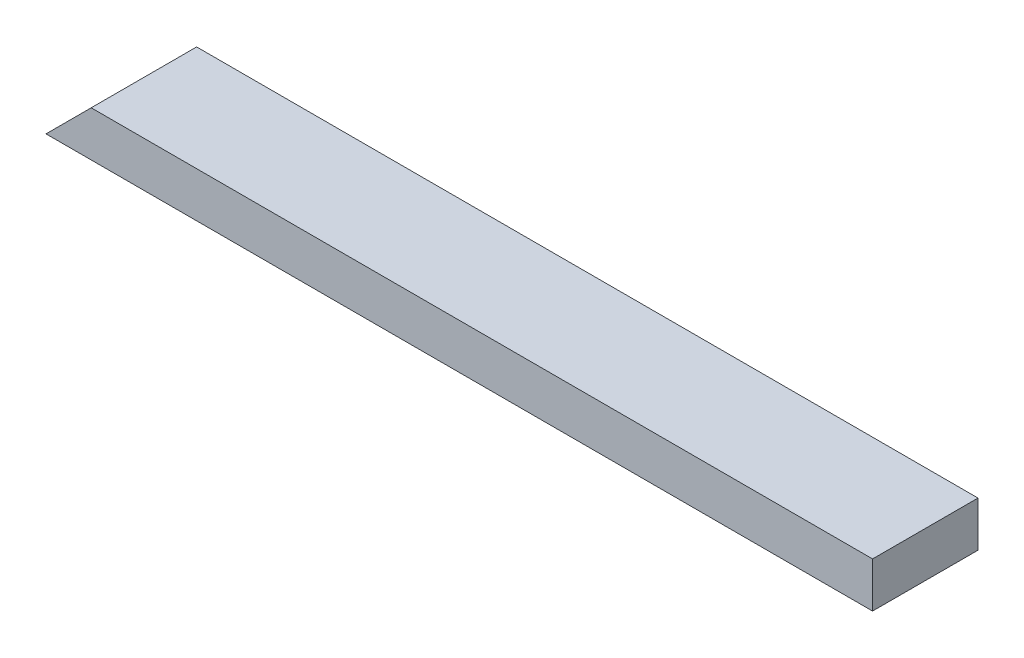
ISO-10303-21;
HEADER;
FILE_DESCRIPTION(('STEP AP214'),'2;1');
FILE_NAME('part.step','',(''),(''),'','','');
FILE_SCHEMA(('AUTOMOTIVE_DESIGN { 1 0 10303 214 1 1 1 1 }'));
ENDSEC;
DATA;
#1=APPLICATION_CONTEXT('core data for automotive mechanical design processes');
#2=APPLICATION_PROTOCOL_DEFINITION('international standard','automotive_design',2000,#1);
#3=PRODUCT_CONTEXT('',#1,'mechanical');
#4=PRODUCT('Part','Part','',(#3));
#5=PRODUCT_RELATED_PRODUCT_CATEGORY('part','',(#4));
#6=PRODUCT_DEFINITION_FORMATION('','',#4);
#7=PRODUCT_DEFINITION_CONTEXT('part definition',#1,'design');
#8=PRODUCT_DEFINITION('design','',#6,#7);
#9=PRODUCT_DEFINITION_SHAPE('','',#8);
#10=(LENGTH_UNIT() NAMED_UNIT(*) SI_UNIT(.MILLI.,.METRE.));
#11=(NAMED_UNIT(*) PLANE_ANGLE_UNIT() SI_UNIT($,.RADIAN.));
#12=(NAMED_UNIT(*) SI_UNIT($,.STERADIAN.) SOLID_ANGLE_UNIT());
#13=UNCERTAINTY_MEASURE_WITH_UNIT(LENGTH_MEASURE(1.E-05),#10,'distance_accuracy_value','');
#14=(GEOMETRIC_REPRESENTATION_CONTEXT(3) GLOBAL_UNCERTAINTY_ASSIGNED_CONTEXT((#13)) GLOBAL_UNIT_ASSIGNED_CONTEXT((#10,
#11,#12)) REPRESENTATION_CONTEXT('',''));
#15=CARTESIAN_POINT('',(0.,0.,0.));
#16=DIRECTION('',(0.,0.,1.));
#17=DIRECTION('',(1.,0.,0.));
#18=AXIS2_PLACEMENT_3D('',#15,#16,#17);
#19=CARTESIAN_POINT('',(0.,38.1,0.));
#20=DIRECTION('',(0.,0.,-1.));
#21=DIRECTION('',(-1.,0.,0.));
#22=AXIS2_PLACEMENT_3D('',#19,#20,#21);
#23=PLANE('',#22);
#24=DIRECTION('',(1.,0.,0.));
#25=VECTOR('',#24,1.);
#26=CARTESIAN_POINT('',(0.,38.1,0.));
#27=LINE('',#26,#25);
#28=CARTESIAN_POINT('',(38.1,38.1,0.));
#29=VERTEX_POINT('',#28);
#30=CARTESIAN_POINT('',(696.9125,38.1,0.));
#31=VERTEX_POINT('',#30);
#32=EDGE_CURVE('E92',#29,#31,#27,.T.);
#33=ORIENTED_EDGE('',*,*,#32,.F.);
#34=DIRECTION('',(0.707106781186547,0.707106781186547,0.));
#35=VECTOR('',#34,1.);
#36=CARTESIAN_POINT('',(0.,0.,0.));
#37=LINE('',#36,#35);
#38=CARTESIAN_POINT('',(0.,0.,0.));
#39=VERTEX_POINT('',#38);
#40=EDGE_CURVE('E86',#39,#29,#37,.T.);
#41=ORIENTED_EDGE('',*,*,#40,.F.);
#42=DIRECTION('',(1.,0.,0.));
#43=VECTOR('',#42,1.);
#44=CARTESIAN_POINT('',(0.,0.,0.));
#45=LINE('',#44,#43);
#46=CARTESIAN_POINT('',(696.9125,0.,0.));
#47=VERTEX_POINT('',#46);
#48=EDGE_CURVE('E96',#39,#47,#45,.T.);
#49=ORIENTED_EDGE('',*,*,#48,.T.);
#50=DIRECTION('',(0.,-1.,0.));
#51=VECTOR('',#50,1.);
#52=CARTESIAN_POINT('',(696.9125,38.1,0.));
#53=LINE('',#52,#51);
#54=EDGE_CURVE('E11',#31,#47,#53,.T.);
#55=ORIENTED_EDGE('',*,*,#54,.F.);
#56=EDGE_LOOP('',(#33,#41,#49,#55));
#57=FACE_BOUND('',#56,.T.);
#58=ADVANCED_FACE('F39',(#57),#23,.F.);
#59=CARTESIAN_POINT('',(696.9125,38.1,0.));
#60=DIRECTION('',(-1.,0.,0.));
#61=DIRECTION('',(0.,0.,1.));
#62=AXIS2_PLACEMENT_3D('',#59,#60,#61);
#63=PLANE('',#62);
#64=DIRECTION('',(0.,0.,-1.));
#65=VECTOR('',#64,1.);
#66=CARTESIAN_POINT('',(696.9125,0.,0.));
#67=LINE('',#66,#65);
#68=CARTESIAN_POINT('',(696.9125,0.,-88.9));
#69=VERTEX_POINT('',#68);
#70=EDGE_CURVE('E67',#47,#69,#67,.T.);
#71=ORIENTED_EDGE('',*,*,#70,.T.);
#72=DIRECTION('',(0.,-1.,0.));
#73=VECTOR('',#72,1.);
#74=CARTESIAN_POINT('',(696.9125,38.1,-88.9));
#75=LINE('',#74,#73);
#76=CARTESIAN_POINT('',(696.9125,38.1,-88.9));
#77=VERTEX_POINT('',#76);
#78=EDGE_CURVE('E47',#77,#69,#75,.T.);
#79=ORIENTED_EDGE('',*,*,#78,.F.);
#80=DIRECTION('',(0.,0.,-1.));
#81=VECTOR('',#80,1.);
#82=CARTESIAN_POINT('',(696.9125,38.1,0.));
#83=LINE('',#82,#81);
#84=EDGE_CURVE('E55',#31,#77,#83,.T.);
#85=ORIENTED_EDGE('',*,*,#84,.F.);
#86=ORIENTED_EDGE('',*,*,#54,.T.);
#87=EDGE_LOOP('',(#71,#79,#85,#86));
#88=FACE_BOUND('',#87,.T.);
#89=ADVANCED_FACE('F111',(#88),#63,.F.);
#90=CARTESIAN_POINT('',(0.,38.1,-88.9));
#91=DIRECTION('',(0.,0.,1.));
#92=DIRECTION('',(1.,0.,0.));
#93=AXIS2_PLACEMENT_3D('',#90,#91,#92);
#94=PLANE('',#93);
#95=DIRECTION('',(-1.,0.,0.));
#96=VECTOR('',#95,1.);
#97=CARTESIAN_POINT('',(0.,0.,-88.9));
#98=LINE('',#97,#96);
#99=CARTESIAN_POINT('',(0.,0.,-88.9));
#100=VERTEX_POINT('',#99);
#101=EDGE_CURVE('E89',#69,#100,#98,.T.);
#102=ORIENTED_EDGE('',*,*,#101,.T.);
#103=DIRECTION('',(0.707106781186547,0.707106781186547,0.));
#104=VECTOR('',#103,1.);
#105=CARTESIAN_POINT('',(0.,0.,-88.9));
#106=LINE('',#105,#104);
#107=CARTESIAN_POINT('',(38.1,38.1,-88.9));
#108=VERTEX_POINT('',#107);
#109=EDGE_CURVE('E74',#100,#108,#106,.T.);
#110=ORIENTED_EDGE('',*,*,#109,.T.);
#111=DIRECTION('',(-1.,0.,0.));
#112=VECTOR('',#111,1.);
#113=CARTESIAN_POINT('',(0.,38.1,-88.9));
#114=LINE('',#113,#112);
#115=EDGE_CURVE('E101',#77,#108,#114,.T.);
#116=ORIENTED_EDGE('',*,*,#115,.F.);
#117=ORIENTED_EDGE('',*,*,#78,.T.);
#118=EDGE_LOOP('',(#102,#110,#116,#117));
#119=FACE_BOUND('',#118,.T.);
#120=ADVANCED_FACE('F90',(#119),#94,.F.);
#121=CARTESIAN_POINT('',(0.,38.1,0.));
#122=DIRECTION('',(0.,-1.,0.));
#123=DIRECTION('',(0.,0.,-1.));
#124=AXIS2_PLACEMENT_3D('',#121,#122,#123);
#125=PLANE('',#124);
#126=ORIENTED_EDGE('',*,*,#115,.T.);
#127=DIRECTION('',(0.,0.,1.));
#128=VECTOR('',#127,1.);
#129=CARTESIAN_POINT('',(38.1,38.1,-88.9));
#130=LINE('',#129,#128);
#131=EDGE_CURVE('E83',#108,#29,#130,.T.);
#132=ORIENTED_EDGE('',*,*,#131,.T.);
#133=ORIENTED_EDGE('',*,*,#32,.T.);
#134=ORIENTED_EDGE('',*,*,#84,.T.);
#135=EDGE_LOOP('',(#126,#132,#133,#134));
#136=FACE_BOUND('',#135,.T.);
#137=ADVANCED_FACE('F109',(#136),#125,.F.);
#138=CARTESIAN_POINT('',(0.,0.,0.));
#139=DIRECTION('',(0.,-1.,0.));
#140=DIRECTION('',(0.,0.,-1.));
#141=AXIS2_PLACEMENT_3D('',#138,#139,#140);
#142=PLANE('',#141);
#143=DIRECTION('',(0.,0.,1.));
#144=VECTOR('',#143,1.);
#145=CARTESIAN_POINT('',(0.,0.,0.));
#146=LINE('',#145,#144);
#147=EDGE_CURVE('E80',#100,#39,#146,.T.);
#148=ORIENTED_EDGE('',*,*,#147,.F.);
#149=ORIENTED_EDGE('',*,*,#101,.F.);
#150=ORIENTED_EDGE('',*,*,#70,.F.);
#151=ORIENTED_EDGE('',*,*,#48,.F.);
#152=EDGE_LOOP('',(#148,#149,#150,#151));
#153=FACE_BOUND('',#152,.T.);
#154=ADVANCED_FACE('F95',(#153),#142,.T.);
#155=CARTESIAN_POINT('',(0.,0.,-88.9));
#156=DIRECTION('',(0.707106781186547,-0.707106781186547,0.));
#157=DIRECTION('',(0.707106781186548,0.707106781186548,0.));
#158=AXIS2_PLACEMENT_3D('',#155,#156,#157);
#159=PLANE('',#158);
#160=ORIENTED_EDGE('',*,*,#40,.T.);
#161=ORIENTED_EDGE('',*,*,#131,.F.);
#162=ORIENTED_EDGE('',*,*,#109,.F.);
#163=ORIENTED_EDGE('',*,*,#147,.T.);
#164=EDGE_LOOP('',(#160,#161,#162,#163));
#165=FACE_BOUND('',#164,.T.);
#166=ADVANCED_FACE('F77',(#165),#159,.F.);
#167=CLOSED_SHELL('',(#58,#89,#120,#137,#154,#166));
#168=MANIFOLD_SOLID_BREP('B2',#167);
#169=ADVANCED_BREP_SHAPE_REPRESENTATION('',(#18,#168),#14);
#170=SHAPE_DEFINITION_REPRESENTATION(#9,#169);
ENDSEC;
END-ISO-10303-21;
